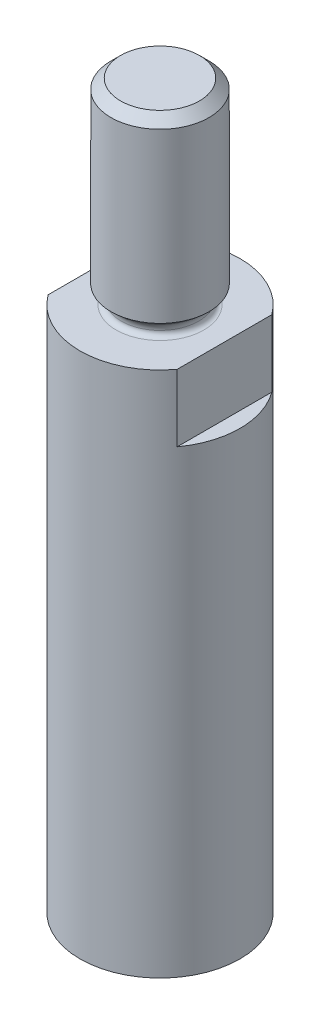
ISO-10303-21;
HEADER;
FILE_DESCRIPTION(('STEP AP214'),'2;1');
FILE_NAME('part.step','',(''),(''),'','','');
FILE_SCHEMA(('AUTOMOTIVE_DESIGN { 1 0 10303 214 1 1 1 1 }'));
ENDSEC;
DATA;
#1=APPLICATION_CONTEXT('core data for automotive mechanical design processes');
#2=APPLICATION_PROTOCOL_DEFINITION('international standard','automotive_design',2000,#1);
#3=PRODUCT_CONTEXT('',#1,'mechanical');
#4=PRODUCT('Part','Part','',(#3));
#5=PRODUCT_RELATED_PRODUCT_CATEGORY('part','',(#4));
#6=PRODUCT_DEFINITION_FORMATION('','',#4);
#7=PRODUCT_DEFINITION_CONTEXT('part definition',#1,'design');
#8=PRODUCT_DEFINITION('design','',#6,#7);
#9=PRODUCT_DEFINITION_SHAPE('','',#8);
#10=(LENGTH_UNIT() NAMED_UNIT(*) SI_UNIT(.MILLI.,.METRE.));
#11=(NAMED_UNIT(*) PLANE_ANGLE_UNIT() SI_UNIT($,.RADIAN.));
#12=(NAMED_UNIT(*) SI_UNIT($,.STERADIAN.) SOLID_ANGLE_UNIT());
#13=UNCERTAINTY_MEASURE_WITH_UNIT(LENGTH_MEASURE(1.E-05),#10,'distance_accuracy_value','');
#14=(GEOMETRIC_REPRESENTATION_CONTEXT(3) GLOBAL_UNCERTAINTY_ASSIGNED_CONTEXT((#13)) GLOBAL_UNIT_ASSIGNED_CONTEXT((#10,
#11,#12)) REPRESENTATION_CONTEXT('',''));
#15=CARTESIAN_POINT('',(0.,0.,0.));
#16=DIRECTION('',(0.,0.,1.));
#17=DIRECTION('',(1.,0.,0.));
#18=AXIS2_PLACEMENT_3D('',#15,#16,#17);
#19=CARTESIAN_POINT('',(0.,35.56,0.));
#20=DIRECTION('',(0.,-1.,0.));
#21=DIRECTION('',(0.,0.,-1.));
#22=AXIS2_PLACEMENT_3D('',#19,#20,#21);
#23=PLANE('',#22);
#24=CARTESIAN_POINT('',(0.,35.5599999999754,0.));
#25=DIRECTION('',(0.,-1.,0.));
#26=DIRECTION('',(0.,0.,-1.));
#27=AXIS2_PLACEMENT_3D('',#24,#25,#26);
#28=CIRCLE('',#27,1.94055999998);
#29=CARTESIAN_POINT('',(0.,35.5599999999754,-1.94055999998));
#30=VERTEX_POINT('',#29);
#31=EDGE_CURVE('E20',#30,#30,#28,.T.);
#32=ORIENTED_EDGE('',*,*,#31,.F.);
#33=EDGE_LOOP('',(#32));
#34=FACE_BOUND('',#33,.T.);
#35=ADVANCED_FACE('F17',(#34),#23,.F.);
#36=CARTESIAN_POINT('',(0.,35.0875600000791,0.));
#37=DIRECTION('',(0.,-1.,0.));
#38=DIRECTION('',(0.,0.,-1.));
#39=AXIS2_PLACEMENT_3D('',#36,#37,#38);
#40=CONICAL_SURFACE('',#39,2.41299999987632,0.785398163397448);
#41=ORIENTED_EDGE('',*,*,#31,.T.);
#42=EDGE_LOOP('',(#41));
#43=FACE_BOUND('',#42,.T.);
#44=CARTESIAN_POINT('',(0.,35.08756,0.));
#45=DIRECTION('',(0.,1.,0.));
#46=DIRECTION('',(0.,0.,1.));
#47=AXIS2_PLACEMENT_3D('',#44,#45,#46);
#48=CIRCLE('',#47,2.413);
#49=CARTESIAN_POINT('',(0.,35.08756,2.413));
#50=VERTEX_POINT('',#49);
#51=EDGE_CURVE('E160',#50,#50,#48,.F.);
#52=ORIENTED_EDGE('',*,*,#51,.F.);
#53=EDGE_LOOP('',(#52));
#54=FACE_BOUND('',#53,.T.);
#55=ADVANCED_FACE('F247',(#43,#54),#40,.T.);
#56=CARTESIAN_POINT('',(0.,25.908,0.));
#57=DIRECTION('',(0.,1.,0.));
#58=DIRECTION('',(0.,0.,1.));
#59=AXIS2_PLACEMENT_3D('',#56,#57,#58);
#60=CYLINDRICAL_SURFACE('',#59,2.413);
#61=ORIENTED_EDGE('',*,*,#51,.T.);
#62=EDGE_LOOP('',(#61));
#63=FACE_BOUND('',#62,.T.);
#64=CARTESIAN_POINT('',(0.,26.8168626126908,0.));
#65=DIRECTION('',(0.,1.,0.));
#66=DIRECTION('',(0.,0.,1.));
#67=AXIS2_PLACEMENT_3D('',#64,#65,#66);
#68=CIRCLE('',#67,2.41299999999001);
#69=CARTESIAN_POINT('',(0.,26.8168626126908,2.41299999999001));
#70=VERTEX_POINT('',#69);
#71=EDGE_CURVE('E155',#70,#70,#68,.F.);
#72=ORIENTED_EDGE('',*,*,#71,.F.);
#73=EDGE_LOOP('',(#72));
#74=FACE_BOUND('',#73,.T.);
#75=ADVANCED_FACE('F238',(#63,#74),#60,.T.);
#76=CARTESIAN_POINT('',(0.,26.8168626124634,0.));
#77=DIRECTION('',(0.,1.,0.));
#78=DIRECTION('',(0.,0.,1.));
#79=AXIS2_PLACEMENT_3D('',#76,#77,#78);
#80=CONICAL_SURFACE('',#79,2.41299999976263,0.87266462603955);
#81=ORIENTED_EDGE('',*,*,#71,.T.);
#82=EDGE_LOOP('',(#81));
#83=FACE_BOUND('',#82,.T.);
#84=CARTESIAN_POINT('',(0.,26.5428662867617,0.));
#85=DIRECTION('',(0.,-1.,0.));
#86=DIRECTION('',(0.,0.,-1.));
#87=AXIS2_PLACEMENT_3D('',#84,#85,#86);
#88=CIRCLE('',#87,2.08646389427925);
#89=CARTESIAN_POINT('',(0.,26.5428662867617,-2.08646389427925));
#90=VERTEX_POINT('',#89);
#91=EDGE_CURVE('E140',#90,#90,#88,.F.);
#92=ORIENTED_EDGE('',*,*,#91,.T.);
#93=EDGE_LOOP('',(#92));
#94=FACE_BOUND('',#93,.T.);
#95=ADVANCED_FACE('F229',(#83,#94),#80,.T.);
#96=CARTESIAN_POINT('',(0.,26.1537157096573,0.));
#97=DIRECTION('',(0.,-1.,0.));
#98=DIRECTION('',(0.,0.,-1.));
#99=AXIS2_PLACEMENT_3D('',#96,#97,#98);
#100=TOROIDAL_SURFACE('',#99,2.41299999999999,0.507999999999992);
#101=ORIENTED_EDGE('',*,*,#91,.F.);
#102=EDGE_LOOP('',(#101));
#103=FACE_BOUND('',#102,.T.);
#104=CARTESIAN_POINT('',(0.,26.1585685575162,0.));
#105=DIRECTION('',(0.,-1.,0.));
#106=DIRECTION('',(0.,0.,-1.));
#107=AXIS2_PLACEMENT_3D('',#104,#105,#106);
#108=CIRCLE('',#107,1.90502317979296);
#109=CARTESIAN_POINT('',(0.,26.1585685575162,-1.90502317979296));
#110=VERTEX_POINT('',#109);
#111=EDGE_CURVE('E137',#110,#110,#108,.F.);
#112=ORIENTED_EDGE('',*,*,#111,.T.);
#113=EDGE_LOOP('',(#112));
#114=FACE_BOUND('',#113,.T.);
#115=ADVANCED_FACE('F129',(#103,#114),#100,.F.);
#116=CARTESIAN_POINT('',(0.,26.162,0.));
#117=DIRECTION('',(0.,-1.,0.));
#118=DIRECTION('',(0.,0.,-1.));
#119=AXIS2_PLACEMENT_3D('',#116,#117,#118);
#120=TOROIDAL_SURFACE('',#119,2.15899999999998,0.253999999999983);
#121=ORIENTED_EDGE('',*,*,#111,.F.);
#122=EDGE_LOOP('',(#121));
#123=FACE_BOUND('',#122,.T.);
#124=CARTESIAN_POINT('',(0.,25.908,0.));
#125=DIRECTION('',(0.,1.,0.));
#126=DIRECTION('',(0.,0.,-1.));
#127=AXIS2_PLACEMENT_3D('',#124,#125,#126);
#128=CIRCLE('',#127,2.15899999999999);
#129=CARTESIAN_POINT('',(0.,25.908,-2.15899999999998));
#130=VERTEX_POINT('',#129);
#131=EDGE_CURVE('E68',#130,#130,#128,.T.);
#132=ORIENTED_EDGE('',*,*,#131,.T.);
#133=EDGE_LOOP('',(#132));
#134=FACE_BOUND('',#133,.T.);
#135=ADVANCED_FACE('F123',(#123,#134),#120,.F.);
#136=CARTESIAN_POINT('',(3.937,0.,0.));
#137=DIRECTION('',(0.,1.,0.));
#138=DIRECTION('',(0.,0.,1.));
#139=AXIS2_PLACEMENT_3D('',#136,#137,#138);
#140=PLANE('',#139);
#141=CARTESIAN_POINT('',(0.,0.,0.));
#142=DIRECTION('',(0.,1.,0.));
#143=DIRECTION('',(0.,0.,1.));
#144=AXIS2_PLACEMENT_3D('',#141,#142,#143);
#145=CIRCLE('',#144,3.937);
#146=CARTESIAN_POINT('',(0.,0.,3.937));
#147=VERTEX_POINT('',#146);
#148=EDGE_CURVE('E84',#147,#147,#145,.T.);
#149=ORIENTED_EDGE('',*,*,#148,.F.);
#150=EDGE_LOOP('',(#149));
#151=FACE_BOUND('',#150,.T.);
#152=ADVANCED_FACE('F119',(#151),#140,.F.);
#153=CARTESIAN_POINT('',(0.,22.606,0.));
#154=DIRECTION('',(0.,1.,0.));
#155=DIRECTION('',(0.,0.,1.));
#156=AXIS2_PLACEMENT_3D('',#153,#154,#155);
#157=PLANE('',#156);
#158=CARTESIAN_POINT('',(0.,22.606,0.));
#159=DIRECTION('',(0.,1.,0.));
#160=DIRECTION('',(0.,0.,1.));
#161=AXIS2_PLACEMENT_3D('',#158,#159,#160);
#162=CIRCLE('',#161,3.937);
#163=CARTESIAN_POINT('',(-3.175,22.606,2.32794845303757));
#164=VERTEX_POINT('',#163);
#165=CARTESIAN_POINT('',(-3.175,22.606,-2.32794845303757));
#166=VERTEX_POINT('',#165);
#167=EDGE_CURVE('E77',#164,#166,#162,.F.);
#168=ORIENTED_EDGE('',*,*,#167,.F.);
#169=DIRECTION('',(0.,0.,1.));
#170=VECTOR('',#169,1.);
#171=CARTESIAN_POINT('',(-3.175,22.606,-7.874));
#172=LINE('',#171,#170);
#173=EDGE_CURVE('E69',#166,#164,#172,.T.);
#174=ORIENTED_EDGE('',*,*,#173,.F.);
#175=EDGE_LOOP('',(#168,#174));
#176=FACE_BOUND('',#175,.T.);
#177=ADVANCED_FACE('F116',(#176),#157,.T.);
#178=CARTESIAN_POINT('',(-3.175,22.606,-7.874));
#179=DIRECTION('',(-1.,0.,0.));
#180=DIRECTION('',(0.,0.,1.));
#181=AXIS2_PLACEMENT_3D('',#178,#179,#180);
#182=PLANE('',#181);
#183=DIRECTION('',(0.,1.,0.));
#184=VECTOR('',#183,1.);
#185=CARTESIAN_POINT('',(-3.175,0.,2.32794845303757));
#186=LINE('',#185,#184);
#187=CARTESIAN_POINT('',(-3.175,25.908,2.32794845303757));
#188=VERTEX_POINT('',#187);
#189=EDGE_CURVE('E72',#188,#164,#186,.F.);
#190=ORIENTED_EDGE('',*,*,#189,.F.);
#191=DIRECTION('',(0.,0.,-1.));
#192=VECTOR('',#191,1.);
#193=CARTESIAN_POINT('',(-3.175,25.908,0.));
#194=LINE('',#193,#192);
#195=CARTESIAN_POINT('',(-3.175,25.908,-2.32794845303757));
#196=VERTEX_POINT('',#195);
#197=EDGE_CURVE('E57',#188,#196,#194,.T.);
#198=ORIENTED_EDGE('',*,*,#197,.T.);
#199=DIRECTION('',(0.,1.,0.));
#200=VECTOR('',#199,1.);
#201=CARTESIAN_POINT('',(-3.175,0.,-2.32794845303757));
#202=LINE('',#201,#200);
#203=EDGE_CURVE('E166',#166,#196,#202,.T.);
#204=ORIENTED_EDGE('',*,*,#203,.F.);
#205=ORIENTED_EDGE('',*,*,#173,.T.);
#206=EDGE_LOOP('',(#190,#198,#204,#205));
#207=FACE_BOUND('',#206,.T.);
#208=ADVANCED_FACE('F73',(#207),#182,.T.);
#209=CARTESIAN_POINT('',(0.,25.908,0.));
#210=DIRECTION('',(0.,-1.,0.));
#211=DIRECTION('',(0.,0.,-1.));
#212=AXIS2_PLACEMENT_3D('',#209,#210,#211);
#213=PLANE('',#212);
#214=ORIENTED_EDGE('',*,*,#131,.F.);
#215=EDGE_LOOP('',(#214));
#216=FACE_BOUND('',#215,.T.);
#217=CARTESIAN_POINT('',(0.,25.908,0.));
#218=DIRECTION('',(0.,1.,0.));
#219=DIRECTION('',(0.,0.,1.));
#220=AXIS2_PLACEMENT_3D('',#217,#218,#219);
#221=CIRCLE('',#220,3.937);
#222=CARTESIAN_POINT('',(3.175,25.908,-2.32794845303757));
#223=VERTEX_POINT('',#222);
#224=EDGE_CURVE('E64',#196,#223,#221,.F.);
#225=ORIENTED_EDGE('',*,*,#224,.F.);
#226=ORIENTED_EDGE('',*,*,#197,.F.);
#227=CARTESIAN_POINT('',(0.,25.908,0.));
#228=DIRECTION('',(0.,1.,0.));
#229=DIRECTION('',(0.,0.,1.));
#230=AXIS2_PLACEMENT_3D('',#227,#228,#229);
#231=CIRCLE('',#230,3.937);
#232=CARTESIAN_POINT('',(3.175,25.908,2.32794845303757));
#233=VERTEX_POINT('',#232);
#234=EDGE_CURVE('E61',#233,#188,#231,.F.);
#235=ORIENTED_EDGE('',*,*,#234,.F.);
#236=DIRECTION('',(0.,0.,-1.));
#237=VECTOR('',#236,1.);
#238=CARTESIAN_POINT('',(3.175,25.908,7.874));
#239=LINE('',#238,#237);
#240=EDGE_CURVE('E52',#223,#233,#239,.F.);
#241=ORIENTED_EDGE('',*,*,#240,.F.);
#242=EDGE_LOOP('',(#225,#226,#235,#241));
#243=FACE_BOUND('',#242,.T.);
#244=ADVANCED_FACE('F59',(#216,#243),#213,.F.);
#245=CARTESIAN_POINT('',(3.175,22.606,7.874));
#246=DIRECTION('',(1.,0.,0.));
#247=DIRECTION('',(0.,0.,-1.));
#248=AXIS2_PLACEMENT_3D('',#245,#246,#247);
#249=PLANE('',#248);
#250=DIRECTION('',(0.,1.,0.));
#251=VECTOR('',#250,1.);
#252=CARTESIAN_POINT('',(3.175,0.,-2.32794845303757));
#253=LINE('',#252,#251);
#254=CARTESIAN_POINT('',(3.175,22.606,-2.32794845303757));
#255=VERTEX_POINT('',#254);
#256=EDGE_CURVE('E26',#223,#255,#253,.F.);
#257=ORIENTED_EDGE('',*,*,#256,.F.);
#258=ORIENTED_EDGE('',*,*,#240,.T.);
#259=DIRECTION('',(0.,1.,0.));
#260=VECTOR('',#259,1.);
#261=CARTESIAN_POINT('',(3.175,0.,2.32794845303757));
#262=LINE('',#261,#260);
#263=CARTESIAN_POINT('',(3.175,22.606,2.32794845303757));
#264=VERTEX_POINT('',#263);
#265=EDGE_CURVE('E82',#264,#233,#262,.T.);
#266=ORIENTED_EDGE('',*,*,#265,.F.);
#267=DIRECTION('',(0.,0.,1.));
#268=VECTOR('',#267,1.);
#269=CARTESIAN_POINT('',(3.175,22.606,0.));
#270=LINE('',#269,#268);
#271=EDGE_CURVE('E35',#255,#264,#270,.T.);
#272=ORIENTED_EDGE('',*,*,#271,.F.);
#273=EDGE_LOOP('',(#257,#258,#266,#272));
#274=FACE_BOUND('',#273,.T.);
#275=ADVANCED_FACE('F112',(#274),#249,.T.);
#276=CARTESIAN_POINT('',(0.,22.606,0.));
#277=DIRECTION('',(0.,1.,0.));
#278=DIRECTION('',(0.,0.,1.));
#279=AXIS2_PLACEMENT_3D('',#276,#277,#278);
#280=PLANE('',#279);
#281=ORIENTED_EDGE('',*,*,#271,.T.);
#282=CARTESIAN_POINT('',(0.,22.606,0.));
#283=DIRECTION('',(0.,1.,0.));
#284=DIRECTION('',(0.,0.,1.));
#285=AXIS2_PLACEMENT_3D('',#282,#283,#284);
#286=CIRCLE('',#285,3.937);
#287=EDGE_CURVE('E11',#255,#264,#286,.F.);
#288=ORIENTED_EDGE('',*,*,#287,.F.);
#289=EDGE_LOOP('',(#281,#288));
#290=FACE_BOUND('',#289,.T.);
#291=ADVANCED_FACE('F168',(#290),#280,.T.);
#292=CARTESIAN_POINT('',(0.,0.,0.));
#293=DIRECTION('',(0.,1.,0.));
#294=DIRECTION('',(0.,0.,1.));
#295=AXIS2_PLACEMENT_3D('',#292,#293,#294);
#296=CYLINDRICAL_SURFACE('',#295,3.937);
#297=ORIENTED_EDGE('',*,*,#256,.T.);
#298=ORIENTED_EDGE('',*,*,#287,.T.);
#299=ORIENTED_EDGE('',*,*,#265,.T.);
#300=ORIENTED_EDGE('',*,*,#234,.T.);
#301=ORIENTED_EDGE('',*,*,#189,.T.);
#302=ORIENTED_EDGE('',*,*,#167,.T.);
#303=ORIENTED_EDGE('',*,*,#203,.T.);
#304=ORIENTED_EDGE('',*,*,#224,.T.);
#305=EDGE_LOOP('',(#297,#298,#299,#300,#301,#302,#303,#304));
#306=FACE_BOUND('',#305,.T.);
#307=ORIENTED_EDGE('',*,*,#148,.T.);
#308=EDGE_LOOP('',(#307));
#309=FACE_BOUND('',#308,.T.);
#310=ADVANCED_FACE('F80',(#306,#309),#296,.T.);
#311=CLOSED_SHELL('',(#35,#55,#75,#95,#115,#135,#152,#177,#208,#244,#275,#291,#310));
#312=MANIFOLD_SOLID_BREP('B1',#311);
#313=ADVANCED_BREP_SHAPE_REPRESENTATION('',(#18,#312),#14);
#314=SHAPE_DEFINITION_REPRESENTATION(#9,#313);
ENDSEC;
END-ISO-10303-21;
